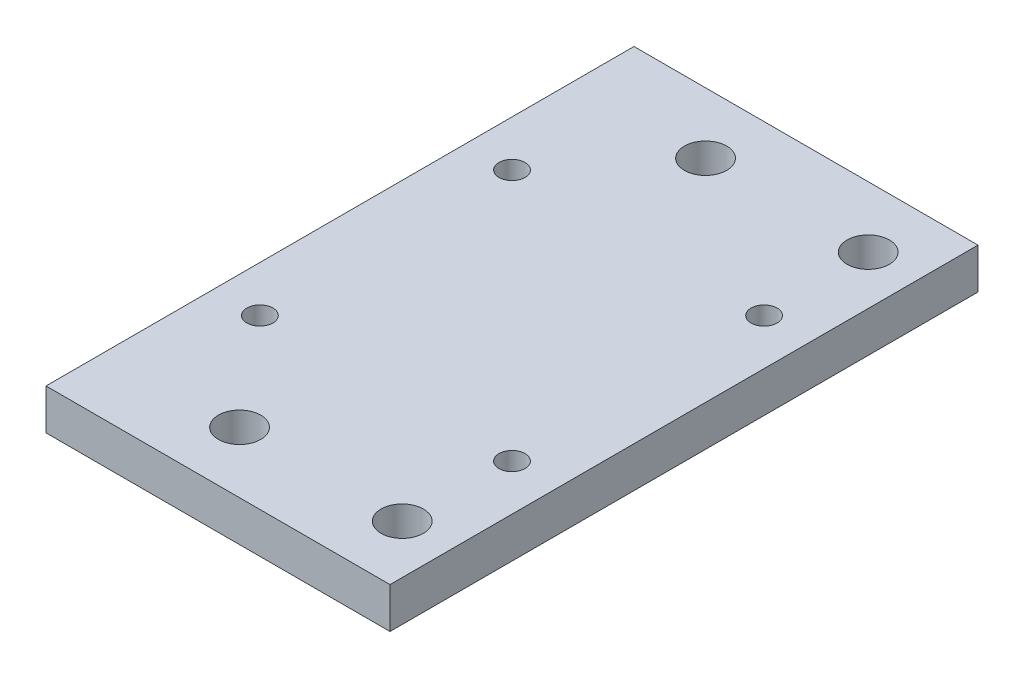
ISO-10303-21;
HEADER;
FILE_DESCRIPTION(('STEP AP214'),'2;1');
FILE_NAME('part.step','',(''),(''),'','','');
FILE_SCHEMA(('AUTOMOTIVE_DESIGN { 1 0 10303 214 1 1 1 1 }'));
ENDSEC;
DATA;
#1=APPLICATION_CONTEXT('core data for automotive mechanical design processes');
#2=APPLICATION_PROTOCOL_DEFINITION('international standard','automotive_design',2000,#1);
#3=PRODUCT_CONTEXT('',#1,'mechanical');
#4=PRODUCT('Part','Part','',(#3));
#5=PRODUCT_RELATED_PRODUCT_CATEGORY('part','',(#4));
#6=PRODUCT_DEFINITION_FORMATION('','',#4);
#7=PRODUCT_DEFINITION_CONTEXT('part definition',#1,'design');
#8=PRODUCT_DEFINITION('design','',#6,#7);
#9=PRODUCT_DEFINITION_SHAPE('','',#8);
#10=(LENGTH_UNIT() NAMED_UNIT(*) SI_UNIT(.MILLI.,.METRE.));
#11=(NAMED_UNIT(*) PLANE_ANGLE_UNIT() SI_UNIT($,.RADIAN.));
#12=(NAMED_UNIT(*) SI_UNIT($,.STERADIAN.) SOLID_ANGLE_UNIT());
#13=UNCERTAINTY_MEASURE_WITH_UNIT(LENGTH_MEASURE(1.E-05),#10,'distance_accuracy_value','');
#14=(GEOMETRIC_REPRESENTATION_CONTEXT(3) GLOBAL_UNCERTAINTY_ASSIGNED_CONTEXT((#13)) GLOBAL_UNIT_ASSIGNED_CONTEXT((#10,
#11,#12)) REPRESENTATION_CONTEXT('',''));
#15=CARTESIAN_POINT('',(0.,0.,0.));
#16=DIRECTION('',(0.,0.,1.));
#17=DIRECTION('',(1.,0.,0.));
#18=AXIS2_PLACEMENT_3D('',#15,#16,#17);
#19=CARTESIAN_POINT('',(-21.15,5.,0.));
#20=DIRECTION('',(-1.,0.,0.));
#21=DIRECTION('',(0.,0.,1.));
#22=AXIS2_PLACEMENT_3D('',#19,#20,#21);
#23=PLANE('',#22);
#24=DIRECTION('',(0.,0.,-1.));
#25=VECTOR('',#24,1.);
#26=CARTESIAN_POINT('',(-21.15,0.,0.));
#27=LINE('',#26,#25);
#28=CARTESIAN_POINT('',(-21.15,0.,36.15));
#29=VERTEX_POINT('',#28);
#30=CARTESIAN_POINT('',(-21.15,0.,-36.15));
#31=VERTEX_POINT('',#30);
#32=EDGE_CURVE('E125',#29,#31,#27,.T.);
#33=ORIENTED_EDGE('',*,*,#32,.F.);
#34=DIRECTION('',(0.,-1.,0.));
#35=VECTOR('',#34,1.);
#36=CARTESIAN_POINT('',(-21.15,5.,36.15));
#37=LINE('',#36,#35);
#38=CARTESIAN_POINT('',(-21.15,5.,36.15));
#39=VERTEX_POINT('',#38);
#40=EDGE_CURVE('E11',#39,#29,#37,.T.);
#41=ORIENTED_EDGE('',*,*,#40,.F.);
#42=DIRECTION('',(0.,0.,-1.));
#43=VECTOR('',#42,1.);
#44=CARTESIAN_POINT('',(-21.15,5.,0.));
#45=LINE('',#44,#43);
#46=CARTESIAN_POINT('',(-21.15,5.,-36.15));
#47=VERTEX_POINT('',#46);
#48=EDGE_CURVE('E94',#39,#47,#45,.T.);
#49=ORIENTED_EDGE('',*,*,#48,.T.);
#50=DIRECTION('',(0.,-1.,0.));
#51=VECTOR('',#50,1.);
#52=CARTESIAN_POINT('',(-21.15,5.,-36.15));
#53=LINE('',#52,#51);
#54=EDGE_CURVE('E51',#47,#31,#53,.T.);
#55=ORIENTED_EDGE('',*,*,#54,.T.);
#56=EDGE_LOOP('',(#33,#41,#49,#55));
#57=FACE_BOUND('',#56,.T.);
#58=ADVANCED_FACE('F34',(#57),#23,.T.);
#59=CARTESIAN_POINT('',(0.,5.,36.15));
#60=DIRECTION('',(0.,0.,1.));
#61=DIRECTION('',(1.,0.,0.));
#62=AXIS2_PLACEMENT_3D('',#59,#60,#61);
#63=PLANE('',#62);
#64=DIRECTION('',(-1.,0.,0.));
#65=VECTOR('',#64,1.);
#66=CARTESIAN_POINT('',(0.,0.,36.15));
#67=LINE('',#66,#65);
#68=CARTESIAN_POINT('',(21.15,0.,36.15));
#69=VERTEX_POINT('',#68);
#70=EDGE_CURVE('E83',#69,#29,#67,.T.);
#71=ORIENTED_EDGE('',*,*,#70,.F.);
#72=DIRECTION('',(0.,-1.,0.));
#73=VECTOR('',#72,1.);
#74=CARTESIAN_POINT('',(21.15,5.,36.15));
#75=LINE('',#74,#73);
#76=CARTESIAN_POINT('',(21.15,5.,36.15));
#77=VERTEX_POINT('',#76);
#78=EDGE_CURVE('E43',#77,#69,#75,.T.);
#79=ORIENTED_EDGE('',*,*,#78,.F.);
#80=DIRECTION('',(-1.,0.,0.));
#81=VECTOR('',#80,1.);
#82=CARTESIAN_POINT('',(0.,5.,36.15));
#83=LINE('',#82,#81);
#84=EDGE_CURVE('E81',#77,#39,#83,.T.);
#85=ORIENTED_EDGE('',*,*,#84,.T.);
#86=ORIENTED_EDGE('',*,*,#40,.T.);
#87=EDGE_LOOP('',(#71,#79,#85,#86));
#88=FACE_BOUND('',#87,.T.);
#89=ADVANCED_FACE('F79',(#88),#63,.T.);
#90=CARTESIAN_POINT('',(21.15,5.,0.));
#91=DIRECTION('',(-1.,0.,0.));
#92=DIRECTION('',(0.,0.,1.));
#93=AXIS2_PLACEMENT_3D('',#90,#91,#92);
#94=PLANE('',#93);
#95=DIRECTION('',(0.,0.,-1.));
#96=VECTOR('',#95,1.);
#97=CARTESIAN_POINT('',(21.15,0.,0.));
#98=LINE('',#97,#96);
#99=CARTESIAN_POINT('',(21.15,0.,-36.15));
#100=VERTEX_POINT('',#99);
#101=EDGE_CURVE('E128',#69,#100,#98,.T.);
#102=ORIENTED_EDGE('',*,*,#101,.T.);
#103=DIRECTION('',(0.,-1.,0.));
#104=VECTOR('',#103,1.);
#105=CARTESIAN_POINT('',(21.15,5.,-36.15));
#106=LINE('',#105,#104);
#107=CARTESIAN_POINT('',(21.15,5.,-36.15));
#108=VERTEX_POINT('',#107);
#109=EDGE_CURVE('E65',#108,#100,#106,.T.);
#110=ORIENTED_EDGE('',*,*,#109,.F.);
#111=DIRECTION('',(0.,0.,-1.));
#112=VECTOR('',#111,1.);
#113=CARTESIAN_POINT('',(21.15,5.,0.));
#114=LINE('',#113,#112);
#115=EDGE_CURVE('E86',#77,#108,#114,.T.);
#116=ORIENTED_EDGE('',*,*,#115,.F.);
#117=ORIENTED_EDGE('',*,*,#78,.T.);
#118=EDGE_LOOP('',(#102,#110,#116,#117));
#119=FACE_BOUND('',#118,.T.);
#120=ADVANCED_FACE('F87',(#119),#94,.F.);
#121=CARTESIAN_POINT('',(15.15,5.,28.65));
#122=DIRECTION('',(0.,-1.,0.));
#123=DIRECTION('',(0.,0.,-1.));
#124=AXIS2_PLACEMENT_3D('',#121,#122,#123);
#125=CYLINDRICAL_SURFACE('',#124,2.6);
#126=CARTESIAN_POINT('',(15.15,5.,28.65));
#127=DIRECTION('',(0.,1.,0.));
#128=DIRECTION('',(0.,0.,1.));
#129=AXIS2_PLACEMENT_3D('',#126,#127,#128);
#130=CIRCLE('',#129,2.6);
#131=CARTESIAN_POINT('',(15.15,5.,31.25));
#132=VERTEX_POINT('',#131);
#133=EDGE_CURVE('E107',#132,#132,#130,.T.);
#134=ORIENTED_EDGE('',*,*,#133,.T.);
#135=EDGE_LOOP('',(#134));
#136=FACE_BOUND('',#135,.T.);
#137=CARTESIAN_POINT('',(15.15,0.,28.65));
#138=DIRECTION('',(0.,1.,0.));
#139=DIRECTION('',(0.,0.,1.));
#140=AXIS2_PLACEMENT_3D('',#137,#138,#139);
#141=CIRCLE('',#140,2.6);
#142=CARTESIAN_POINT('',(15.15,0.,31.25));
#143=VERTEX_POINT('',#142);
#144=EDGE_CURVE('E139',#143,#143,#141,.T.);
#145=ORIENTED_EDGE('',*,*,#144,.F.);
#146=EDGE_LOOP('',(#145));
#147=FACE_BOUND('',#146,.T.);
#148=ADVANCED_FACE('F215',(#136,#147),#125,.F.);
#149=CARTESIAN_POINT('',(-4.85,5.,-28.65));
#150=DIRECTION('',(0.,-1.,0.));
#151=DIRECTION('',(0.,0.,-1.));
#152=AXIS2_PLACEMENT_3D('',#149,#150,#151);
#153=CYLINDRICAL_SURFACE('',#152,2.6);
#154=CARTESIAN_POINT('',(-4.85,5.,-28.65));
#155=DIRECTION('',(0.,1.,0.));
#156=DIRECTION('',(0.,0.,1.));
#157=AXIS2_PLACEMENT_3D('',#154,#155,#156);
#158=CIRCLE('',#157,2.6);
#159=CARTESIAN_POINT('',(-4.85,5.,-26.05));
#160=VERTEX_POINT('',#159);
#161=EDGE_CURVE('E104',#160,#160,#158,.T.);
#162=ORIENTED_EDGE('',*,*,#161,.T.);
#163=EDGE_LOOP('',(#162));
#164=FACE_BOUND('',#163,.T.);
#165=CARTESIAN_POINT('',(-4.85,0.,-28.65));
#166=DIRECTION('',(0.,1.,0.));
#167=DIRECTION('',(0.,0.,1.));
#168=AXIS2_PLACEMENT_3D('',#165,#166,#167);
#169=CIRCLE('',#168,2.6);
#170=CARTESIAN_POINT('',(-4.85,0.,-26.05));
#171=VERTEX_POINT('',#170);
#172=EDGE_CURVE('E136',#171,#171,#169,.T.);
#173=ORIENTED_EDGE('',*,*,#172,.F.);
#174=EDGE_LOOP('',(#173));
#175=FACE_BOUND('',#174,.T.);
#176=ADVANCED_FACE('F217',(#164,#175),#153,.F.);
#177=CARTESIAN_POINT('',(15.15,5.,-28.65));
#178=DIRECTION('',(0.,-1.,0.));
#179=DIRECTION('',(0.,0.,-1.));
#180=AXIS2_PLACEMENT_3D('',#177,#178,#179);
#181=CYLINDRICAL_SURFACE('',#180,2.6);
#182=CARTESIAN_POINT('',(15.15,5.,-28.65));
#183=DIRECTION('',(0.,1.,0.));
#184=DIRECTION('',(0.,0.,1.));
#185=AXIS2_PLACEMENT_3D('',#182,#183,#184);
#186=CIRCLE('',#185,2.6);
#187=CARTESIAN_POINT('',(15.15,5.,-26.05));
#188=VERTEX_POINT('',#187);
#189=EDGE_CURVE('E101',#188,#188,#186,.T.);
#190=ORIENTED_EDGE('',*,*,#189,.T.);
#191=EDGE_LOOP('',(#190));
#192=FACE_BOUND('',#191,.T.);
#193=CARTESIAN_POINT('',(15.15,0.,-28.65));
#194=DIRECTION('',(0.,1.,0.));
#195=DIRECTION('',(0.,0.,1.));
#196=AXIS2_PLACEMENT_3D('',#193,#194,#195);
#197=CIRCLE('',#196,2.6);
#198=CARTESIAN_POINT('',(15.15,0.,-26.05));
#199=VERTEX_POINT('',#198);
#200=EDGE_CURVE('E133',#199,#199,#197,.T.);
#201=ORIENTED_EDGE('',*,*,#200,.F.);
#202=EDGE_LOOP('',(#201));
#203=FACE_BOUND('',#202,.T.);
#204=ADVANCED_FACE('F224',(#192,#203),#181,.F.);
#205=CARTESIAN_POINT('',(0.,5.,-36.15));
#206=DIRECTION('',(0.,0.,-1.));
#207=DIRECTION('',(-1.,0.,0.));
#208=AXIS2_PLACEMENT_3D('',#205,#206,#207);
#209=PLANE('',#208);
#210=DIRECTION('',(1.,0.,0.));
#211=VECTOR('',#210,1.);
#212=CARTESIAN_POINT('',(0.,0.,-36.15));
#213=LINE('',#212,#211);
#214=EDGE_CURVE('E130',#31,#100,#213,.T.);
#215=ORIENTED_EDGE('',*,*,#214,.F.);
#216=ORIENTED_EDGE('',*,*,#54,.F.);
#217=DIRECTION('',(1.,0.,0.));
#218=VECTOR('',#217,1.);
#219=CARTESIAN_POINT('',(0.,5.,-36.15));
#220=LINE('',#219,#218);
#221=EDGE_CURVE('E90',#47,#108,#220,.T.);
#222=ORIENTED_EDGE('',*,*,#221,.T.);
#223=ORIENTED_EDGE('',*,*,#109,.T.);
#224=EDGE_LOOP('',(#215,#216,#222,#223));
#225=FACE_BOUND('',#224,.T.);
#226=ADVANCED_FACE('F190',(#225),#209,.T.);
#227=CARTESIAN_POINT('',(-15.5,5.,-15.5));
#228=DIRECTION('',(0.,-1.,0.));
#229=DIRECTION('',(0.,0.,-1.));
#230=AXIS2_PLACEMENT_3D('',#227,#228,#229);
#231=CYLINDRICAL_SURFACE('',#230,1.6);
#232=CARTESIAN_POINT('',(-15.5,5.,-15.5));
#233=DIRECTION('',(0.,1.,0.));
#234=DIRECTION('',(0.,0.,1.));
#235=AXIS2_PLACEMENT_3D('',#232,#233,#234);
#236=CIRCLE('',#235,1.6);
#237=CARTESIAN_POINT('',(-15.5,5.,-13.9));
#238=VERTEX_POINT('',#237);
#239=EDGE_CURVE('E96',#238,#238,#236,.T.);
#240=ORIENTED_EDGE('',*,*,#239,.T.);
#241=EDGE_LOOP('',(#240));
#242=FACE_BOUND('',#241,.T.);
#243=CARTESIAN_POINT('',(-15.5,0.,-15.5));
#244=DIRECTION('',(0.,1.,0.));
#245=DIRECTION('',(0.,0.,1.));
#246=AXIS2_PLACEMENT_3D('',#243,#244,#245);
#247=CIRCLE('',#246,1.6);
#248=CARTESIAN_POINT('',(-15.5,0.,-13.9));
#249=VERTEX_POINT('',#248);
#250=EDGE_CURVE('E122',#249,#249,#247,.T.);
#251=ORIENTED_EDGE('',*,*,#250,.F.);
#252=EDGE_LOOP('',(#251));
#253=FACE_BOUND('',#252,.T.);
#254=ADVANCED_FACE('F162',(#242,#253),#231,.F.);
#255=CARTESIAN_POINT('',(15.5,5.,15.5));
#256=DIRECTION('',(0.,-1.,0.));
#257=DIRECTION('',(0.,0.,-1.));
#258=AXIS2_PLACEMENT_3D('',#255,#256,#257);
#259=CYLINDRICAL_SURFACE('',#258,1.6);
#260=CARTESIAN_POINT('',(15.5,5.,15.5));
#261=DIRECTION('',(0.,1.,0.));
#262=DIRECTION('',(0.,0.,1.));
#263=AXIS2_PLACEMENT_3D('',#260,#261,#262);
#264=CIRCLE('',#263,1.6);
#265=CARTESIAN_POINT('',(15.5,5.,17.1));
#266=VERTEX_POINT('',#265);
#267=EDGE_CURVE('E155',#266,#266,#264,.T.);
#268=ORIENTED_EDGE('',*,*,#267,.T.);
#269=EDGE_LOOP('',(#268));
#270=FACE_BOUND('',#269,.T.);
#271=CARTESIAN_POINT('',(15.5,0.,15.5));
#272=DIRECTION('',(0.,1.,0.));
#273=DIRECTION('',(0.,0.,1.));
#274=AXIS2_PLACEMENT_3D('',#271,#272,#273);
#275=CIRCLE('',#274,1.6);
#276=CARTESIAN_POINT('',(15.5,0.,17.1));
#277=VERTEX_POINT('',#276);
#278=EDGE_CURVE('E119',#277,#277,#275,.T.);
#279=ORIENTED_EDGE('',*,*,#278,.F.);
#280=EDGE_LOOP('',(#279));
#281=FACE_BOUND('',#280,.T.);
#282=ADVANCED_FACE('F189',(#270,#281),#259,.F.);
#283=CARTESIAN_POINT('',(15.5,5.,-15.5));
#284=DIRECTION('',(0.,-1.,0.));
#285=DIRECTION('',(0.,0.,-1.));
#286=AXIS2_PLACEMENT_3D('',#283,#284,#285);
#287=CYLINDRICAL_SURFACE('',#286,1.6);
#288=CARTESIAN_POINT('',(15.5,5.,-15.5));
#289=DIRECTION('',(0.,1.,0.));
#290=DIRECTION('',(0.,0.,1.));
#291=AXIS2_PLACEMENT_3D('',#288,#289,#290);
#292=CIRCLE('',#291,1.6);
#293=CARTESIAN_POINT('',(15.5,5.,-13.9));
#294=VERTEX_POINT('',#293);
#295=EDGE_CURVE('E150',#294,#294,#292,.T.);
#296=ORIENTED_EDGE('',*,*,#295,.T.);
#297=EDGE_LOOP('',(#296));
#298=FACE_BOUND('',#297,.T.);
#299=CARTESIAN_POINT('',(15.5,0.,-15.5));
#300=DIRECTION('',(0.,1.,0.));
#301=DIRECTION('',(0.,0.,1.));
#302=AXIS2_PLACEMENT_3D('',#299,#300,#301);
#303=CIRCLE('',#302,1.6);
#304=CARTESIAN_POINT('',(15.5,0.,-13.9));
#305=VERTEX_POINT('',#304);
#306=EDGE_CURVE('E116',#305,#305,#303,.T.);
#307=ORIENTED_EDGE('',*,*,#306,.F.);
#308=EDGE_LOOP('',(#307));
#309=FACE_BOUND('',#308,.T.);
#310=ADVANCED_FACE('F192',(#298,#309),#287,.F.);
#311=CARTESIAN_POINT('',(-15.5,5.,15.5));
#312=DIRECTION('',(0.,-1.,0.));
#313=DIRECTION('',(0.,0.,-1.));
#314=AXIS2_PLACEMENT_3D('',#311,#312,#313);
#315=CYLINDRICAL_SURFACE('',#314,1.6);
#316=CARTESIAN_POINT('',(-15.5,5.,15.5));
#317=DIRECTION('',(0.,1.,0.));
#318=DIRECTION('',(0.,0.,1.));
#319=AXIS2_PLACEMENT_3D('',#316,#317,#318);
#320=CIRCLE('',#319,1.6);
#321=CARTESIAN_POINT('',(-15.5,5.,17.1));
#322=VERTEX_POINT('',#321);
#323=EDGE_CURVE('E145',#322,#322,#320,.T.);
#324=ORIENTED_EDGE('',*,*,#323,.T.);
#325=EDGE_LOOP('',(#324));
#326=FACE_BOUND('',#325,.T.);
#327=CARTESIAN_POINT('',(-15.5,0.,15.5));
#328=DIRECTION('',(0.,1.,0.));
#329=DIRECTION('',(0.,0.,1.));
#330=AXIS2_PLACEMENT_3D('',#327,#328,#329);
#331=CIRCLE('',#330,1.6);
#332=CARTESIAN_POINT('',(-15.5,0.,17.1));
#333=VERTEX_POINT('',#332);
#334=EDGE_CURVE('E113',#333,#333,#331,.T.);
#335=ORIENTED_EDGE('',*,*,#334,.F.);
#336=EDGE_LOOP('',(#335));
#337=FACE_BOUND('',#336,.T.);
#338=ADVANCED_FACE('F36',(#326,#337),#315,.F.);
#339=CARTESIAN_POINT('',(-4.84999999999999,5.,28.65));
#340=DIRECTION('',(0.,-1.,0.));
#341=DIRECTION('',(0.,0.,-1.));
#342=AXIS2_PLACEMENT_3D('',#339,#340,#341);
#343=CYLINDRICAL_SURFACE('',#342,2.6);
#344=CARTESIAN_POINT('',(-4.84999999999999,5.,28.65));
#345=DIRECTION('',(0.,1.,0.));
#346=DIRECTION('',(0.,0.,1.));
#347=AXIS2_PLACEMENT_3D('',#344,#345,#346);
#348=CIRCLE('',#347,2.6);
#349=CARTESIAN_POINT('',(-4.84999999999999,5.,31.25));
#350=VERTEX_POINT('',#349);
#351=EDGE_CURVE('E110',#350,#350,#348,.T.);
#352=ORIENTED_EDGE('',*,*,#351,.T.);
#353=EDGE_LOOP('',(#352));
#354=FACE_BOUND('',#353,.T.);
#355=CARTESIAN_POINT('',(-4.84999999999999,0.,28.65));
#356=DIRECTION('',(0.,1.,0.));
#357=DIRECTION('',(0.,0.,1.));
#358=AXIS2_PLACEMENT_3D('',#355,#356,#357);
#359=CIRCLE('',#358,2.6);
#360=CARTESIAN_POINT('',(-4.84999999999999,0.,31.25));
#361=VERTEX_POINT('',#360);
#362=EDGE_CURVE('E142',#361,#361,#359,.T.);
#363=ORIENTED_EDGE('',*,*,#362,.F.);
#364=EDGE_LOOP('',(#363));
#365=FACE_BOUND('',#364,.T.);
#366=ADVANCED_FACE('F167',(#354,#365),#343,.F.);
#367=CARTESIAN_POINT('',(0.,5.,0.));
#368=DIRECTION('',(0.,1.,0.));
#369=DIRECTION('',(0.,0.,1.));
#370=AXIS2_PLACEMENT_3D('',#367,#368,#369);
#371=PLANE('',#370);
#372=ORIENTED_EDGE('',*,*,#323,.F.);
#373=EDGE_LOOP('',(#372));
#374=FACE_BOUND('',#373,.T.);
#375=ORIENTED_EDGE('',*,*,#295,.F.);
#376=EDGE_LOOP('',(#375));
#377=FACE_BOUND('',#376,.T.);
#378=ORIENTED_EDGE('',*,*,#267,.F.);
#379=EDGE_LOOP('',(#378));
#380=FACE_BOUND('',#379,.T.);
#381=ORIENTED_EDGE('',*,*,#239,.F.);
#382=EDGE_LOOP('',(#381));
#383=FACE_BOUND('',#382,.T.);
#384=ORIENTED_EDGE('',*,*,#48,.F.);
#385=ORIENTED_EDGE('',*,*,#84,.F.);
#386=ORIENTED_EDGE('',*,*,#115,.T.);
#387=ORIENTED_EDGE('',*,*,#221,.F.);
#388=EDGE_LOOP('',(#384,#385,#386,#387));
#389=FACE_BOUND('',#388,.T.);
#390=ORIENTED_EDGE('',*,*,#189,.F.);
#391=EDGE_LOOP('',(#390));
#392=FACE_BOUND('',#391,.T.);
#393=ORIENTED_EDGE('',*,*,#161,.F.);
#394=EDGE_LOOP('',(#393));
#395=FACE_BOUND('',#394,.T.);
#396=ORIENTED_EDGE('',*,*,#133,.F.);
#397=EDGE_LOOP('',(#396));
#398=FACE_BOUND('',#397,.T.);
#399=ORIENTED_EDGE('',*,*,#351,.F.);
#400=EDGE_LOOP('',(#399));
#401=FACE_BOUND('',#400,.T.);
#402=ADVANCED_FACE('F92',(#374,#377,#380,#383,#389,#392,#395,#398,#401),#371,.T.);
#403=CARTESIAN_POINT('',(0.,0.,0.));
#404=DIRECTION('',(0.,1.,0.));
#405=DIRECTION('',(0.,0.,1.));
#406=AXIS2_PLACEMENT_3D('',#403,#404,#405);
#407=PLANE('',#406);
#408=ORIENTED_EDGE('',*,*,#334,.T.);
#409=EDGE_LOOP('',(#408));
#410=FACE_BOUND('',#409,.T.);
#411=ORIENTED_EDGE('',*,*,#306,.T.);
#412=EDGE_LOOP('',(#411));
#413=FACE_BOUND('',#412,.T.);
#414=ORIENTED_EDGE('',*,*,#278,.T.);
#415=EDGE_LOOP('',(#414));
#416=FACE_BOUND('',#415,.T.);
#417=ORIENTED_EDGE('',*,*,#250,.T.);
#418=EDGE_LOOP('',(#417));
#419=FACE_BOUND('',#418,.T.);
#420=ORIENTED_EDGE('',*,*,#32,.T.);
#421=ORIENTED_EDGE('',*,*,#214,.T.);
#422=ORIENTED_EDGE('',*,*,#101,.F.);
#423=ORIENTED_EDGE('',*,*,#70,.T.);
#424=EDGE_LOOP('',(#420,#421,#422,#423));
#425=FACE_BOUND('',#424,.T.);
#426=ORIENTED_EDGE('',*,*,#200,.T.);
#427=EDGE_LOOP('',(#426));
#428=FACE_BOUND('',#427,.T.);
#429=ORIENTED_EDGE('',*,*,#172,.T.);
#430=EDGE_LOOP('',(#429));
#431=FACE_BOUND('',#430,.T.);
#432=ORIENTED_EDGE('',*,*,#144,.T.);
#433=EDGE_LOOP('',(#432));
#434=FACE_BOUND('',#433,.T.);
#435=ORIENTED_EDGE('',*,*,#362,.T.);
#436=EDGE_LOOP('',(#435));
#437=FACE_BOUND('',#436,.T.);
#438=ADVANCED_FACE('F166',(#410,#413,#416,#419,#425,#428,#431,#434,#437),#407,.F.);
#439=CLOSED_SHELL('',(#58,#89,#120,#148,#176,#204,#226,#254,#282,#310,#338,#366,#402,#438));
#440=MANIFOLD_SOLID_BREP('B2',#439);
#441=ADVANCED_BREP_SHAPE_REPRESENTATION('',(#18,#440),#14);
#442=SHAPE_DEFINITION_REPRESENTATION(#9,#441);
ENDSEC;
END-ISO-10303-21;
